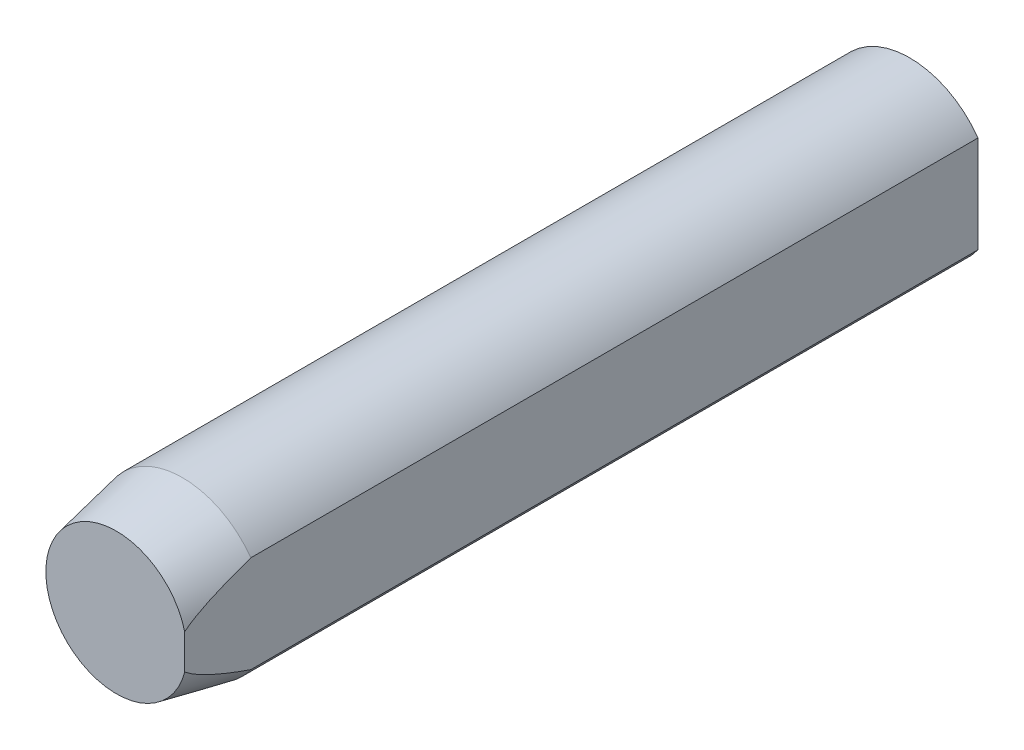
ISO-10303-21;
HEADER;
FILE_DESCRIPTION(('STEP AP214'),'2;1');
FILE_NAME('part.step','',(''),(''),'','','');
FILE_SCHEMA(('AUTOMOTIVE_DESIGN { 1 0 10303 214 1 1 1 1 }'));
ENDSEC;
DATA;
#1=APPLICATION_CONTEXT('core data for automotive mechanical design processes');
#2=APPLICATION_PROTOCOL_DEFINITION('international standard','automotive_design',2000,#1);
#3=PRODUCT_CONTEXT('',#1,'mechanical');
#4=PRODUCT('Part','Part','',(#3));
#5=PRODUCT_RELATED_PRODUCT_CATEGORY('part','',(#4));
#6=PRODUCT_DEFINITION_FORMATION('','',#4);
#7=PRODUCT_DEFINITION_CONTEXT('part definition',#1,'design');
#8=PRODUCT_DEFINITION('design','',#6,#7);
#9=PRODUCT_DEFINITION_SHAPE('','',#8);
#10=(LENGTH_UNIT() NAMED_UNIT(*) SI_UNIT(.MILLI.,.METRE.));
#11=(NAMED_UNIT(*) PLANE_ANGLE_UNIT() SI_UNIT($,.RADIAN.));
#12=(NAMED_UNIT(*) SI_UNIT($,.STERADIAN.) SOLID_ANGLE_UNIT());
#13=UNCERTAINTY_MEASURE_WITH_UNIT(LENGTH_MEASURE(1.E-05),#10,'distance_accuracy_value','');
#14=(GEOMETRIC_REPRESENTATION_CONTEXT(3) GLOBAL_UNCERTAINTY_ASSIGNED_CONTEXT((#13)) GLOBAL_UNIT_ASSIGNED_CONTEXT((#10,
#11,#12)) REPRESENTATION_CONTEXT('',''));
#15=CARTESIAN_POINT('',(0.,0.,0.));
#16=DIRECTION('',(0.,0.,1.));
#17=DIRECTION('',(1.,0.,0.));
#18=AXIS2_PLACEMENT_3D('',#15,#16,#17);
#19=CARTESIAN_POINT('',(0.,0.,18.));
#20=DIRECTION('',(0.,0.,-1.));
#21=DIRECTION('',(-1.,0.,0.));
#22=AXIS2_PLACEMENT_3D('',#19,#20,#21);
#23=CYLINDRICAL_SURFACE('',#22,1.9);
#24=CARTESIAN_POINT('',(0.,0.,16.5));
#25=DIRECTION('',(0.,0.,1.));
#26=DIRECTION('',(1.,0.,0.));
#27=AXIS2_PLACEMENT_3D('',#24,#25,#26);
#28=CIRCLE('',#27,1.9);
#29=CARTESIAN_POINT('',(1.55,-1.0988630487918,16.5));
#30=VERTEX_POINT('',#29);
#31=CARTESIAN_POINT('',(1.55,1.0988630487918,16.5));
#32=VERTEX_POINT('',#31);
#33=EDGE_CURVE('E83',#30,#32,#28,.F.);
#34=ORIENTED_EDGE('',*,*,#33,.T.);
#35=DIRECTION('',(0.,0.,-1.));
#36=VECTOR('',#35,1.);
#37=CARTESIAN_POINT('',(1.55,1.0988630487918,18.));
#38=LINE('',#37,#36);
#39=CARTESIAN_POINT('',(1.55,1.0988630487918,0.));
#40=VERTEX_POINT('',#39);
#41=EDGE_CURVE('E61',#32,#40,#38,.T.);
#42=ORIENTED_EDGE('',*,*,#41,.T.);
#43=CARTESIAN_POINT('',(0.,0.,0.));
#44=DIRECTION('',(0.,0.,1.));
#45=DIRECTION('',(1.,0.,0.));
#46=AXIS2_PLACEMENT_3D('',#43,#44,#45);
#47=CIRCLE('',#46,1.9);
#48=CARTESIAN_POINT('',(1.55,-1.0988630487918,0.));
#49=VERTEX_POINT('',#48);
#50=EDGE_CURVE('E84',#40,#49,#47,.T.);
#51=ORIENTED_EDGE('',*,*,#50,.T.);
#52=DIRECTION('',(0.,0.,-1.));
#53=VECTOR('',#52,1.);
#54=CARTESIAN_POINT('',(1.55,-1.0988630487918,18.));
#55=LINE('',#54,#53);
#56=EDGE_CURVE('E80',#49,#30,#55,.F.);
#57=ORIENTED_EDGE('',*,*,#56,.T.);
#58=EDGE_LOOP('',(#34,#42,#51,#57));
#59=FACE_BOUND('',#58,.T.);
#60=ADVANCED_FACE('F36',(#59),#23,.T.);
#61=CARTESIAN_POINT('',(0.,0.,18.));
#62=DIRECTION('',(0.,0.,1.));
#63=DIRECTION('',(1.,0.,0.));
#64=AXIS2_PLACEMENT_3D('',#61,#62,#63);
#65=PLANE('',#64);
#66=DIRECTION('',(0.,1.,0.));
#67=VECTOR('',#66,1.);
#68=CARTESIAN_POINT('',(1.55,-1.66810214786923,18.));
#69=LINE('',#68,#67);
#70=CARTESIAN_POINT('',(1.55,-0.396862696659671,18.));
#71=VERTEX_POINT('',#70);
#72=CARTESIAN_POINT('',(1.55,0.396862696659671,18.));
#73=VERTEX_POINT('',#72);
#74=EDGE_CURVE('E55',#71,#73,#69,.T.);
#75=ORIENTED_EDGE('',*,*,#74,.T.);
#76=CARTESIAN_POINT('',(0.,0.,18.));
#77=DIRECTION('',(0.,0.,1.));
#78=DIRECTION('',(1.,0.,0.));
#79=AXIS2_PLACEMENT_3D('',#76,#77,#78);
#80=CIRCLE('',#79,1.6);
#81=EDGE_CURVE('E79',#73,#71,#80,.T.);
#82=ORIENTED_EDGE('',*,*,#81,.T.);
#83=EDGE_LOOP('',(#75,#82));
#84=FACE_BOUND('',#83,.T.);
#85=ADVANCED_FACE('F78',(#84),#65,.T.);
#86=CARTESIAN_POINT('',(0.,0.,0.));
#87=DIRECTION('',(0.,0.,1.));
#88=DIRECTION('',(1.,0.,0.));
#89=AXIS2_PLACEMENT_3D('',#86,#87,#88);
#90=PLANE('',#89);
#91=ORIENTED_EDGE('',*,*,#50,.F.);
#92=DIRECTION('',(0.,1.,0.));
#93=VECTOR('',#92,1.);
#94=CARTESIAN_POINT('',(1.55,-1.66810214786923,0.));
#95=LINE('',#94,#93);
#96=EDGE_CURVE('E81',#49,#40,#95,.T.);
#97=ORIENTED_EDGE('',*,*,#96,.F.);
#98=EDGE_LOOP('',(#91,#97));
#99=FACE_BOUND('',#98,.T.);
#100=ADVANCED_FACE('F96',(#99),#90,.F.);
#101=CARTESIAN_POINT('',(0.,0.,18.));
#102=DIRECTION('',(0.,0.,-1.));
#103=DIRECTION('',(-1.,0.,0.));
#104=AXIS2_PLACEMENT_3D('',#101,#102,#103);
#105=CONICAL_SURFACE('',#104,1.6,0.197395559849878);
#106=CARTESIAN_POINT('',(1.55,1.75167545862447,14.305057810802));
#107=CARTESIAN_POINT('',(1.55,1.71964850697764,14.4249569215896));
#108=CARTESIAN_POINT('',(1.55,1.68727392463289,14.5447643712527));
#109=CARTESIAN_POINT('',(1.55,1.62166965589241,14.7841595606513));
#110=CARTESIAN_POINT('',(1.55,1.58843987140749,14.9037472734832));
#111=CARTESIAN_POINT('',(1.55,1.52078544425063,15.1433018674464));
#112=CARTESIAN_POINT('',(1.55,1.4863551937284,15.2632671694213));
#113=CARTESIAN_POINT('',(1.55,1.41625620840685,15.502825425634));
#114=CARTESIAN_POINT('',(1.55,1.3805875733708,15.6224184090238));
#115=CARTESIAN_POINT('',(1.55,1.30140518732703,15.8818130165034));
#116=CARTESIAN_POINT('',(1.55,1.25760268090376,16.0215270927877));
#117=CARTESIAN_POINT('',(1.55,1.16717720043734,16.3000853574177));
#118=CARTESIAN_POINT('',(1.55,1.12055345655216,16.4389292968158));
#119=CARTESIAN_POINT('',(1.55,1.02356422288139,16.7148239105697));
#120=CARTESIAN_POINT('',(1.55,0.973211340018042,16.8518789363006));
#121=CARTESIAN_POINT('',(1.55,0.893320400602329,17.0557202543668));
#122=CARTESIAN_POINT('',(1.55,0.865970061574302,17.1233615320951));
#123=CARTESIAN_POINT('',(1.55,0.809399310631471,17.2578540826758));
#124=CARTESIAN_POINT('',(1.55,0.78017910836471,17.3247054431012));
#125=CARTESIAN_POINT('',(1.55,0.720892307983625,17.4537866135874));
#126=CARTESIAN_POINT('',(1.55,0.690952179478971,17.5160738727152));
#127=CARTESIAN_POINT('',(1.55,0.628013008265306,17.6392911110451));
#128=CARTESIAN_POINT('',(1.55,0.595006489370218,17.700217298557));
#129=CARTESIAN_POINT('',(1.55,0.525580536815659,17.8181904085026));
#130=CARTESIAN_POINT('',(1.55,0.48926419136654,17.8752957411972));
#131=CARTESIAN_POINT('',(1.55,0.430221520967707,17.9575469253324));
#132=CARTESIAN_POINT('',(1.55,0.409820176458781,17.9843508705678));
#133=CARTESIAN_POINT('',(1.55,0.367058932957736,18.0363334777168));
#134=CARTESIAN_POINT('',(1.55,0.344701256161065,18.0615139286855));
#135=CARTESIAN_POINT('',(1.55,0.303619764510536,18.1031750804178));
#136=CARTESIAN_POINT('',(1.55,0.285466773839724,18.1202131778254));
#137=CARTESIAN_POINT('',(1.55,0.247472346906909,18.1524029770667));
#138=CARTESIAN_POINT('',(1.55,0.227628002017733,18.1675513142211));
#139=CARTESIAN_POINT('',(1.55,0.185763731117051,18.1952393447944));
#140=CARTESIAN_POINT('',(1.55,0.163718249398469,18.2077414243726));
#141=CARTESIAN_POINT('',(1.55,0.117712538035427,18.2285160606437));
#142=CARTESIAN_POINT('',(1.55,0.0937592322900883,18.236803171845));
#143=CARTESIAN_POINT('',(1.55,0.0517036370038341,18.2461821692046));
#144=CARTESIAN_POINT('',(1.55,0.0339126952690292,18.2486618346219));
#145=CARTESIAN_POINT('',(1.55,-0.00182757592675066,18.2505079830568));
#146=CARTESIAN_POINT('',(1.55,-0.019776802062195,18.2498763657301));
#147=CARTESIAN_POINT('',(1.55,-0.0552476693456076,18.2455850462567));
#148=CARTESIAN_POINT('',(1.55,-0.0727703469615398,18.2419336424963));
#149=CARTESIAN_POINT('',(1.55,-0.107054401213244,18.2320100827051));
#150=CARTESIAN_POINT('',(1.55,-0.123814917253989,18.2257350418581));
#151=CARTESIAN_POINT('',(1.55,-0.166166118427682,18.2066758633353));
#152=CARTESIAN_POINT('',(1.55,-0.19100872767147,18.192246409305));
#153=CARTESIAN_POINT('',(1.55,-0.238259810846916,18.1598532061158));
#154=CARTESIAN_POINT('',(1.55,-0.260660404017898,18.1418785113278));
#155=CARTESIAN_POINT('',(1.55,-0.309711217600055,18.0979782737288));
#156=CARTESIAN_POINT('',(1.55,-0.335654200661647,18.0712748909541));
#157=CARTESIAN_POINT('',(1.55,-0.384908855941957,18.0155143037628));
#158=CARTESIAN_POINT('',(1.55,-0.408214994124724,17.9864523609701));
#159=CARTESIAN_POINT('',(1.55,-0.452918674985286,17.9266343344159));
#160=CARTESIAN_POINT('',(1.55,-0.474303669411519,17.8958689742249));
#161=CARTESIAN_POINT('',(1.55,-0.515431337344425,17.8333171412498));
#162=CARTESIAN_POINT('',(1.55,-0.535175670364867,17.8015317464812));
#163=CARTESIAN_POINT('',(1.55,-0.594338025975659,17.701954245013));
#164=CARTESIAN_POINT('',(1.55,-0.63159774506988,17.6328848394574));
#165=CARTESIAN_POINT('',(1.55,-0.702424587234719,17.492862877633));
#166=CARTESIAN_POINT('',(1.55,-0.735988773323099,17.4219088783999));
#167=CARTESIAN_POINT('',(1.55,-0.800516277778384,17.2786346512102));
#168=CARTESIAN_POINT('',(1.55,-0.83147333537911,17.206311618188));
#169=CARTESIAN_POINT('',(1.55,-0.891364925110452,17.0608292883867));
#170=CARTESIAN_POINT('',(1.55,-0.920299177838262,16.9876698776993));
#171=CARTESIAN_POINT('',(1.55,-1.004841434154,16.767079886365));
#172=CARTESIAN_POINT('',(1.55,-1.05809697031756,16.618750005562));
#173=CARTESIAN_POINT('',(1.55,-1.16043019703717,16.3209098025423));
#174=CARTESIAN_POINT('',(1.55,-1.20951351002884,16.1714013754358));
#175=CARTESIAN_POINT('',(1.55,-1.30239713512966,15.878854492533));
#176=CARTESIAN_POINT('',(1.55,-1.34633861536142,15.7358606833248));
#177=CARTESIAN_POINT('',(1.55,-1.43223178039643,15.449208709732));
#178=CARTESIAN_POINT('',(1.55,-1.4741825476243,15.305550271848));
#179=CARTESIAN_POINT('',(1.55,-1.55609659481681,15.019238291038));
#180=CARTESIAN_POINT('',(1.55,-1.59607566709697,14.876589250096));
#181=CARTESIAN_POINT('',(1.55,-1.67475640829787,14.5910215901815));
#182=CARTESIAN_POINT('',(1.55,-1.71345875416173,14.4481031579671));
#183=CARTESIAN_POINT('',(1.55,-1.7516754586245,14.3050578108019));
#184=B_SPLINE_CURVE_WITH_KNOTS('',3,(#106,#107,#108,#109,#110,#111,#112,#113,#114,#115,#116,
#117,#118,#119,#120,#121,#122,#123,#124,#125,#126,#127,#128,#129,#130,#131,#132,#133,#134,#135,
#136,#137,#138,#139,#140,#141,#142,#143,#144,#145,#146,#147,#148,#149,#150,#151,#152,#153,#154,
#155,#156,#157,#158,#159,#160,#161,#162,#163,#164,#165,#166,#167,#168,#169,#170,#171,#172,#173,
#174,#175,#176,#177,#178,#179,#180,#181,#182,#183),.UNSPECIFIED.,.F.,.F.,(4,2,2,2,2,2,2,2,2,2,2,
2,2,2,2,2,2,2,2,2,2,2,2,2,2,2,2,2,2,2,2,2,2,2,2,2,2,2,4),(0.,0.372309785599747,
0.744662466042913,1.11908168032427,1.49347080135817,1.93270597707674,2.3720615538746,
2.80999424571453,3.02885818498727,3.24769762820377,3.4549646243504,3.66275092985118,
3.86546053670874,3.96645153348335,4.06732926802085,4.14192523542206,4.21665217920588,
4.29237892649391,4.3678423791651,4.42148097461271,4.47508682400825,4.5285458518747,
4.58206381576464,4.66775124143754,4.75370748205714,4.86513037717802,4.97678294360362,
5.08911855550424,5.20133912161726,5.43656986776573,5.67198623160381,5.90795269734227,
6.14395169215059,6.61664354049743,7.08868794844299,7.53744702397068,7.98641097497313,
8.43084114142656,8.87503174652838),.UNSPECIFIED.);
#185=EDGE_CURVE('E11',#32,#73,#184,.T.);
#186=ORIENTED_EDGE('',*,*,#185,.F.);
#187=ORIENTED_EDGE('',*,*,#33,.F.);
#188=EDGE_CURVE('E41',#71,#30,#184,.T.);
#189=ORIENTED_EDGE('',*,*,#188,.F.);
#190=ORIENTED_EDGE('',*,*,#81,.F.);
#191=EDGE_LOOP('',(#186,#187,#189,#190));
#192=FACE_BOUND('',#191,.T.);
#193=ADVANCED_FACE('F38',(#192),#105,.T.);
#194=CARTESIAN_POINT('',(1.55,-1.66810214786923,18.));
#195=DIRECTION('',(-1.,0.,0.));
#196=DIRECTION('',(0.,0.,1.));
#197=AXIS2_PLACEMENT_3D('',#194,#195,#196);
#198=PLANE('',#197);
#199=ORIENTED_EDGE('',*,*,#185,.T.);
#200=ORIENTED_EDGE('',*,*,#74,.F.);
#201=ORIENTED_EDGE('',*,*,#188,.T.);
#202=ORIENTED_EDGE('',*,*,#56,.F.);
#203=ORIENTED_EDGE('',*,*,#96,.T.);
#204=ORIENTED_EDGE('',*,*,#41,.F.);
#205=EDGE_LOOP('',(#199,#200,#201,#202,#203,#204));
#206=FACE_BOUND('',#205,.T.);
#207=ADVANCED_FACE('F71',(#206),#198,.F.);
#208=CLOSED_SHELL('',(#60,#85,#100,#193,#207));
#209=MANIFOLD_SOLID_BREP('B2',#208);
#210=ADVANCED_BREP_SHAPE_REPRESENTATION('',(#18,#209),#14);
#211=SHAPE_DEFINITION_REPRESENTATION(#9,#210);
ENDSEC;
END-ISO-10303-21;
